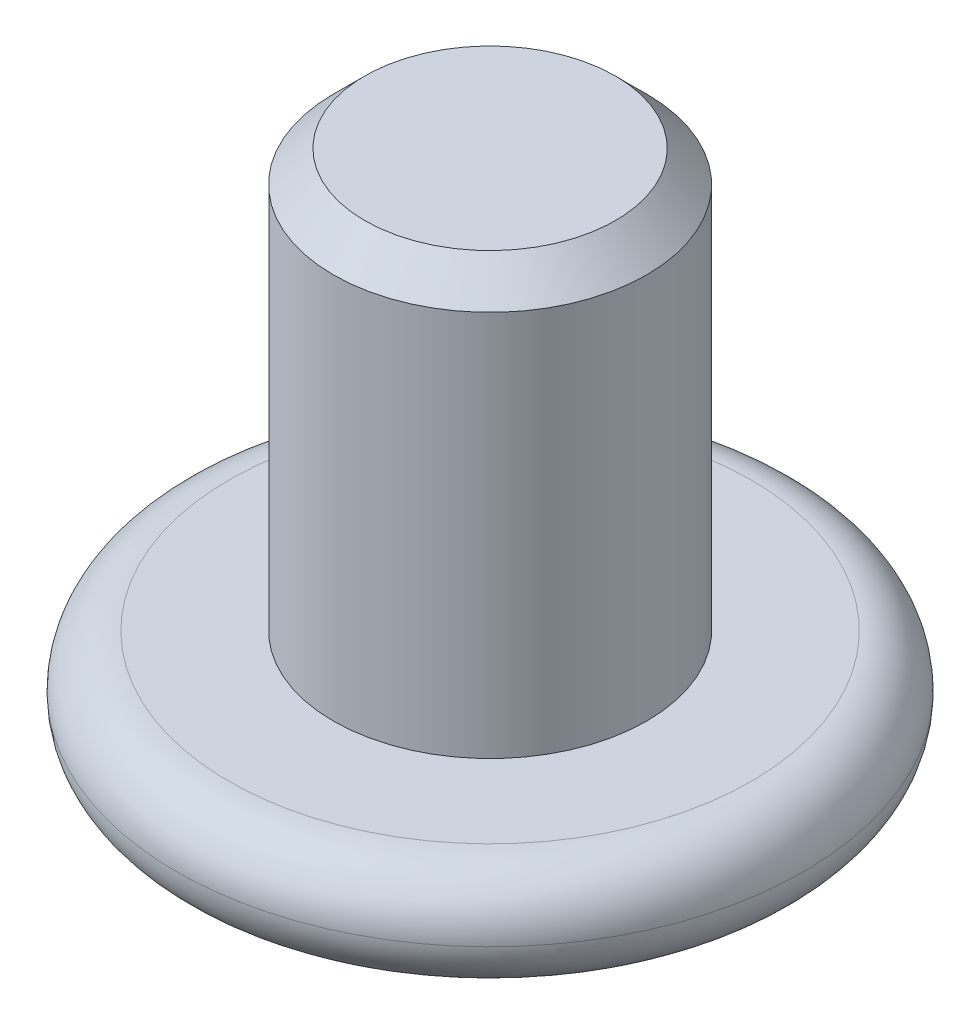
ISO-10303-21;
HEADER;
FILE_DESCRIPTION(('STEP AP214'),'2;1');
FILE_NAME('part.step','',(''),(''),'','','');
FILE_SCHEMA(('AUTOMOTIVE_DESIGN { 1 0 10303 214 1 1 1 1 }'));
ENDSEC;
DATA;
#1=APPLICATION_CONTEXT('core data for automotive mechanical design processes');
#2=APPLICATION_PROTOCOL_DEFINITION('international standard','automotive_design',2000,#1);
#3=PRODUCT_CONTEXT('',#1,'mechanical');
#4=PRODUCT('Part','Part','',(#3));
#5=PRODUCT_RELATED_PRODUCT_CATEGORY('part','',(#4));
#6=PRODUCT_DEFINITION_FORMATION('','',#4);
#7=PRODUCT_DEFINITION_CONTEXT('part definition',#1,'design');
#8=PRODUCT_DEFINITION('design','',#6,#7);
#9=PRODUCT_DEFINITION_SHAPE('','',#8);
#10=(LENGTH_UNIT() NAMED_UNIT(*) SI_UNIT(.MILLI.,.METRE.));
#11=(NAMED_UNIT(*) PLANE_ANGLE_UNIT() SI_UNIT($,.RADIAN.));
#12=(NAMED_UNIT(*) SI_UNIT($,.STERADIAN.) SOLID_ANGLE_UNIT());
#13=UNCERTAINTY_MEASURE_WITH_UNIT(LENGTH_MEASURE(1.E-05),#10,'distance_accuracy_value','');
#14=(GEOMETRIC_REPRESENTATION_CONTEXT(3) GLOBAL_UNCERTAINTY_ASSIGNED_CONTEXT((#13)) GLOBAL_UNIT_ASSIGNED_CONTEXT((#10,
#11,#12)) REPRESENTATION_CONTEXT('',''));
#15=CARTESIAN_POINT('',(0.,0.,0.));
#16=DIRECTION('',(0.,0.,1.));
#17=DIRECTION('',(1.,0.,0.));
#18=AXIS2_PLACEMENT_3D('',#15,#16,#17);
#19=CARTESIAN_POINT('',(0.,4.,0.));
#20=DIRECTION('',(0.,-1.,0.));
#21=DIRECTION('',(0.,0.,-1.));
#22=AXIS2_PLACEMENT_3D('',#19,#20,#21);
#23=CYLINDRICAL_SURFACE('',#22,1.5);
#24=CARTESIAN_POINT('',(0.,3.7,0.));
#25=DIRECTION('',(0.,1.,0.));
#26=DIRECTION('',(0.,0.,1.));
#27=AXIS2_PLACEMENT_3D('',#24,#25,#26);
#28=CIRCLE('',#27,1.5);
#29=CARTESIAN_POINT('',(0.,3.7,1.5));
#30=VERTEX_POINT('',#29);
#31=EDGE_CURVE('E11',#30,#30,#28,.F.);
#32=ORIENTED_EDGE('',*,*,#31,.T.);
#33=EDGE_LOOP('',(#32));
#34=FACE_BOUND('',#33,.T.);
#35=CARTESIAN_POINT('',(0.,0.,0.));
#36=DIRECTION('',(0.,1.,0.));
#37=DIRECTION('',(0.,0.,1.));
#38=AXIS2_PLACEMENT_3D('',#35,#36,#37);
#39=CIRCLE('',#38,1.5);
#40=CARTESIAN_POINT('',(0.,0.,1.5));
#41=VERTEX_POINT('',#40);
#42=EDGE_CURVE('E250',#41,#41,#39,.T.);
#43=ORIENTED_EDGE('',*,*,#42,.T.);
#44=EDGE_LOOP('',(#43));
#45=FACE_BOUND('',#44,.T.);
#46=ADVANCED_FACE('F46',(#34,#45),#23,.T.);
#47=CARTESIAN_POINT('',(0.,4.,0.));
#48=DIRECTION('',(0.,1.,0.));
#49=DIRECTION('',(0.,0.,1.));
#50=AXIS2_PLACEMENT_3D('',#47,#48,#49);
#51=PLANE('',#50);
#52=CARTESIAN_POINT('',(0.,4.,0.));
#53=DIRECTION('',(0.,1.,0.));
#54=DIRECTION('',(0.,0.,1.));
#55=AXIS2_PLACEMENT_3D('',#52,#53,#54);
#56=CIRCLE('',#55,1.2);
#57=CARTESIAN_POINT('',(0.,4.,1.2));
#58=VERTEX_POINT('',#57);
#59=EDGE_CURVE('E56',#58,#58,#56,.T.);
#60=ORIENTED_EDGE('',*,*,#59,.T.);
#61=EDGE_LOOP('',(#60));
#62=FACE_BOUND('',#61,.T.);
#63=ADVANCED_FACE('F268',(#62),#51,.T.);
#64=CARTESIAN_POINT('',(0.,-1.,0.));
#65=DIRECTION('',(0.,-1.,0.));
#66=DIRECTION('',(0.,0.,-1.));
#67=AXIS2_PLACEMENT_3D('',#64,#65,#66);
#68=PLANE('',#67);
#69=DIRECTION('',(0.,0.,-1.));
#70=VECTOR('',#69,1.);
#71=CARTESIAN_POINT('',(-1.5,-1.,-0.2));
#72=LINE('',#71,#70);
#73=CARTESIAN_POINT('',(-1.5,-1.,0.2));
#74=VERTEX_POINT('',#73);
#75=CARTESIAN_POINT('',(-1.5,-1.,-0.2));
#76=VERTEX_POINT('',#75);
#77=EDGE_CURVE('E63',#74,#76,#72,.T.);
#78=ORIENTED_EDGE('',*,*,#77,.F.);
#79=DIRECTION('',(-1.,0.,0.));
#80=VECTOR('',#79,1.);
#81=CARTESIAN_POINT('',(-1.5,-1.,0.2));
#82=LINE('',#81,#80);
#83=CARTESIAN_POINT('',(-0.2,-1.,0.2));
#84=VERTEX_POINT('',#83);
#85=EDGE_CURVE('E216',#84,#74,#82,.T.);
#86=ORIENTED_EDGE('',*,*,#85,.F.);
#87=DIRECTION('',(0.,0.,-1.));
#88=VECTOR('',#87,1.);
#89=CARTESIAN_POINT('',(-0.2,-1.,1.5));
#90=LINE('',#89,#88);
#91=CARTESIAN_POINT('',(-0.2,-1.,1.5));
#92=VERTEX_POINT('',#91);
#93=EDGE_CURVE('E213',#92,#84,#90,.T.);
#94=ORIENTED_EDGE('',*,*,#93,.F.);
#95=DIRECTION('',(-1.,0.,0.));
#96=VECTOR('',#95,1.);
#97=CARTESIAN_POINT('',(-0.2,-1.,1.5));
#98=LINE('',#97,#96);
#99=CARTESIAN_POINT('',(0.2,-1.,1.5));
#100=VERTEX_POINT('',#99);
#101=EDGE_CURVE('E147',#100,#92,#98,.T.);
#102=ORIENTED_EDGE('',*,*,#101,.F.);
#103=DIRECTION('',(0.,0.,1.));
#104=VECTOR('',#103,1.);
#105=CARTESIAN_POINT('',(0.2,-1.,1.5));
#106=LINE('',#105,#104);
#107=CARTESIAN_POINT('',(0.2,-1.,0.2));
#108=VERTEX_POINT('',#107);
#109=EDGE_CURVE('E207',#108,#100,#106,.T.);
#110=ORIENTED_EDGE('',*,*,#109,.F.);
#111=DIRECTION('',(-1.,0.,0.));
#112=VECTOR('',#111,1.);
#113=CARTESIAN_POINT('',(0.2,-1.,0.2));
#114=LINE('',#113,#112);
#115=CARTESIAN_POINT('',(1.5,-1.,0.2));
#116=VERTEX_POINT('',#115);
#117=EDGE_CURVE('E203',#116,#108,#114,.T.);
#118=ORIENTED_EDGE('',*,*,#117,.F.);
#119=DIRECTION('',(0.,0.,1.));
#120=VECTOR('',#119,1.);
#121=CARTESIAN_POINT('',(1.5,-1.,-0.2));
#122=LINE('',#121,#120);
#123=CARTESIAN_POINT('',(1.5,-1.,-0.2));
#124=VERTEX_POINT('',#123);
#125=EDGE_CURVE('E199',#124,#116,#122,.T.);
#126=ORIENTED_EDGE('',*,*,#125,.F.);
#127=DIRECTION('',(1.,0.,0.));
#128=VECTOR('',#127,1.);
#129=CARTESIAN_POINT('',(0.2,-1.,-0.2));
#130=LINE('',#129,#128);
#131=CARTESIAN_POINT('',(0.2,-1.,-0.2));
#132=VERTEX_POINT('',#131);
#133=EDGE_CURVE('E195',#132,#124,#130,.T.);
#134=ORIENTED_EDGE('',*,*,#133,.F.);
#135=DIRECTION('',(0.,0.,1.));
#136=VECTOR('',#135,1.);
#137=CARTESIAN_POINT('',(0.2,-1.,-0.2));
#138=LINE('',#137,#136);
#139=CARTESIAN_POINT('',(0.2,-1.,-1.5));
#140=VERTEX_POINT('',#139);
#141=EDGE_CURVE('E191',#140,#132,#138,.T.);
#142=ORIENTED_EDGE('',*,*,#141,.F.);
#143=DIRECTION('',(1.,0.,0.));
#144=VECTOR('',#143,1.);
#145=CARTESIAN_POINT('',(-0.2,-1.,-1.5));
#146=LINE('',#145,#144);
#147=CARTESIAN_POINT('',(-0.2,-1.,-1.5));
#148=VERTEX_POINT('',#147);
#149=EDGE_CURVE('E187',#148,#140,#146,.T.);
#150=ORIENTED_EDGE('',*,*,#149,.F.);
#151=DIRECTION('',(0.,0.,-1.));
#152=VECTOR('',#151,1.);
#153=CARTESIAN_POINT('',(-0.2,-1.,-0.2));
#154=LINE('',#153,#152);
#155=CARTESIAN_POINT('',(-0.2,-1.,-0.2));
#156=VERTEX_POINT('',#155);
#157=EDGE_CURVE('E183',#156,#148,#154,.T.);
#158=ORIENTED_EDGE('',*,*,#157,.F.);
#159=DIRECTION('',(1.,0.,0.));
#160=VECTOR('',#159,1.);
#161=CARTESIAN_POINT('',(-1.5,-1.,-0.2));
#162=LINE('',#161,#160);
#163=EDGE_CURVE('E179',#76,#156,#162,.T.);
#164=ORIENTED_EDGE('',*,*,#163,.F.);
#165=EDGE_LOOP('',(#78,#86,#94,#102,#110,#118,#126,#134,#142,#150,#158,#164));
#166=FACE_BOUND('',#165,.T.);
#167=CARTESIAN_POINT('',(0.,-1.,0.));
#168=DIRECTION('',(0.,-1.,0.));
#169=DIRECTION('',(0.,0.,-1.));
#170=AXIS2_PLACEMENT_3D('',#167,#168,#169);
#171=CIRCLE('',#170,2.5);
#172=CARTESIAN_POINT('',(0.,-1.,-2.5));
#173=VERTEX_POINT('',#172);
#174=EDGE_CURVE('E258',#173,#173,#171,.T.);
#175=ORIENTED_EDGE('',*,*,#174,.T.);
#176=EDGE_LOOP('',(#175));
#177=FACE_BOUND('',#176,.T.);
#178=ADVANCED_FACE('F284',(#166,#177),#68,.T.);
#179=CARTESIAN_POINT('',(0.,0.,0.));
#180=DIRECTION('',(0.,-1.,0.));
#181=DIRECTION('',(0.,0.,-1.));
#182=AXIS2_PLACEMENT_3D('',#179,#180,#181);
#183=PLANE('',#182);
#184=CARTESIAN_POINT('',(0.,0.,0.));
#185=DIRECTION('',(0.,-1.,0.));
#186=DIRECTION('',(0.,0.,-1.));
#187=AXIS2_PLACEMENT_3D('',#184,#185,#186);
#188=CIRCLE('',#187,2.5);
#189=CARTESIAN_POINT('',(0.,0.,-2.5));
#190=VERTEX_POINT('',#189);
#191=EDGE_CURVE('E254',#190,#190,#188,.F.);
#192=ORIENTED_EDGE('',*,*,#191,.T.);
#193=EDGE_LOOP('',(#192));
#194=FACE_BOUND('',#193,.T.);
#195=ORIENTED_EDGE('',*,*,#42,.F.);
#196=EDGE_LOOP('',(#195));
#197=FACE_BOUND('',#196,.T.);
#198=ADVANCED_FACE('F295',(#194,#197),#183,.F.);
#199=CARTESIAN_POINT('',(0.,-0.5,0.));
#200=DIRECTION('',(0.,-1.,0.));
#201=DIRECTION('',(0.,0.,-1.));
#202=AXIS2_PLACEMENT_3D('',#199,#200,#201);
#203=TOROIDAL_SURFACE('',#202,2.5,0.5);
#204=ORIENTED_EDGE('',*,*,#174,.F.);
#205=EDGE_LOOP('',(#204));
#206=FACE_BOUND('',#205,.T.);
#207=CARTESIAN_POINT('',(0.,-0.5,0.));
#208=DIRECTION('',(0.,-1.,0.));
#209=DIRECTION('',(0.,0.,-1.));
#210=AXIS2_PLACEMENT_3D('',#207,#208,#209);
#211=CIRCLE('',#210,3.);
#212=CARTESIAN_POINT('',(0.,-0.5,-3.));
#213=VERTEX_POINT('',#212);
#214=EDGE_CURVE('E222',#213,#213,#211,.F.);
#215=ORIENTED_EDGE('',*,*,#214,.F.);
#216=EDGE_LOOP('',(#215));
#217=FACE_BOUND('',#216,.T.);
#218=ADVANCED_FACE('F292',(#206,#217),#203,.T.);
#219=CARTESIAN_POINT('',(0.,-0.5,0.));
#220=DIRECTION('',(0.,-1.,0.));
#221=DIRECTION('',(0.,0.,-1.));
#222=AXIS2_PLACEMENT_3D('',#219,#220,#221);
#223=TOROIDAL_SURFACE('',#222,2.5,0.5);
#224=ORIENTED_EDGE('',*,*,#191,.F.);
#225=EDGE_LOOP('',(#224));
#226=FACE_BOUND('',#225,.T.);
#227=ORIENTED_EDGE('',*,*,#214,.T.);
#228=EDGE_LOOP('',(#227));
#229=FACE_BOUND('',#228,.T.);
#230=ADVANCED_FACE('F289',(#226,#229),#223,.T.);
#231=CARTESIAN_POINT('',(-1.5,-0.5,-0.2));
#232=DIRECTION('',(-1.,0.,0.));
#233=DIRECTION('',(0.,0.,1.));
#234=AXIS2_PLACEMENT_3D('',#231,#232,#233);
#235=PLANE('',#234);
#236=ORIENTED_EDGE('',*,*,#77,.T.);
#237=DIRECTION('',(0.,-1.,0.));
#238=VECTOR('',#237,1.);
#239=CARTESIAN_POINT('',(-1.5,-0.5,-0.2));
#240=LINE('',#239,#238);
#241=CARTESIAN_POINT('',(-1.5,-0.5,-0.2));
#242=VERTEX_POINT('',#241);
#243=EDGE_CURVE('E111',#242,#76,#240,.T.);
#244=ORIENTED_EDGE('',*,*,#243,.F.);
#245=DIRECTION('',(0.,0.,-1.));
#246=VECTOR('',#245,1.);
#247=CARTESIAN_POINT('',(-1.5,-0.5,-0.2));
#248=LINE('',#247,#246);
#249=CARTESIAN_POINT('',(-1.5,-0.5,0.2));
#250=VERTEX_POINT('',#249);
#251=EDGE_CURVE('E219',#250,#242,#248,.T.);
#252=ORIENTED_EDGE('',*,*,#251,.F.);
#253=DIRECTION('',(0.,-1.,0.));
#254=VECTOR('',#253,1.);
#255=CARTESIAN_POINT('',(-1.5,-0.5,0.2));
#256=LINE('',#255,#254);
#257=EDGE_CURVE('E71',#250,#74,#256,.T.);
#258=ORIENTED_EDGE('',*,*,#257,.T.);
#259=EDGE_LOOP('',(#236,#244,#252,#258));
#260=FACE_BOUND('',#259,.T.);
#261=ADVANCED_FACE('F291',(#260),#235,.F.);
#262=CARTESIAN_POINT('',(-1.5,-0.5,0.2));
#263=DIRECTION('',(0.,0.,1.));
#264=DIRECTION('',(1.,0.,0.));
#265=AXIS2_PLACEMENT_3D('',#262,#263,#264);
#266=PLANE('',#265);
#267=ORIENTED_EDGE('',*,*,#85,.T.);
#268=ORIENTED_EDGE('',*,*,#257,.F.);
#269=DIRECTION('',(-1.,0.,0.));
#270=VECTOR('',#269,1.);
#271=CARTESIAN_POINT('',(-1.5,-0.5,0.2));
#272=LINE('',#271,#270);
#273=CARTESIAN_POINT('',(-0.2,-0.5,0.2));
#274=VERTEX_POINT('',#273);
#275=EDGE_CURVE('E161',#274,#250,#272,.T.);
#276=ORIENTED_EDGE('',*,*,#275,.F.);
#277=DIRECTION('',(0.,-1.,0.));
#278=VECTOR('',#277,1.);
#279=CARTESIAN_POINT('',(-0.2,-0.5,0.2));
#280=LINE('',#279,#278);
#281=EDGE_CURVE('E152',#274,#84,#280,.T.);
#282=ORIENTED_EDGE('',*,*,#281,.T.);
#283=EDGE_LOOP('',(#267,#268,#276,#282));
#284=FACE_BOUND('',#283,.T.);
#285=ADVANCED_FACE('F314',(#284),#266,.F.);
#286=CARTESIAN_POINT('',(-0.2,-0.5,1.5));
#287=DIRECTION('',(-1.,0.,0.));
#288=DIRECTION('',(0.,0.,1.));
#289=AXIS2_PLACEMENT_3D('',#286,#287,#288);
#290=PLANE('',#289);
#291=ORIENTED_EDGE('',*,*,#93,.T.);
#292=ORIENTED_EDGE('',*,*,#281,.F.);
#293=DIRECTION('',(0.,0.,-1.));
#294=VECTOR('',#293,1.);
#295=CARTESIAN_POINT('',(-0.2,-0.5,1.5));
#296=LINE('',#295,#294);
#297=CARTESIAN_POINT('',(-0.2,-0.5,1.5));
#298=VERTEX_POINT('',#297);
#299=EDGE_CURVE('E156',#298,#274,#296,.T.);
#300=ORIENTED_EDGE('',*,*,#299,.F.);
#301=DIRECTION('',(0.,-1.,0.));
#302=VECTOR('',#301,1.);
#303=CARTESIAN_POINT('',(-0.2,-0.5,1.5));
#304=LINE('',#303,#302);
#305=EDGE_CURVE('E140',#298,#92,#304,.T.);
#306=ORIENTED_EDGE('',*,*,#305,.T.);
#307=EDGE_LOOP('',(#291,#292,#300,#306));
#308=FACE_BOUND('',#307,.T.);
#309=ADVANCED_FACE('F157',(#308),#290,.F.);
#310=CARTESIAN_POINT('',(-0.2,-0.5,1.5));
#311=DIRECTION('',(0.,0.,1.));
#312=DIRECTION('',(1.,0.,0.));
#313=AXIS2_PLACEMENT_3D('',#310,#311,#312);
#314=PLANE('',#313);
#315=ORIENTED_EDGE('',*,*,#101,.T.);
#316=ORIENTED_EDGE('',*,*,#305,.F.);
#317=DIRECTION('',(-1.,0.,0.));
#318=VECTOR('',#317,1.);
#319=CARTESIAN_POINT('',(-0.2,-0.5,1.5));
#320=LINE('',#319,#318);
#321=CARTESIAN_POINT('',(0.2,-0.5,1.5));
#322=VERTEX_POINT('',#321);
#323=EDGE_CURVE('E144',#322,#298,#320,.T.);
#324=ORIENTED_EDGE('',*,*,#323,.F.);
#325=DIRECTION('',(0.,-1.,0.));
#326=VECTOR('',#325,1.);
#327=CARTESIAN_POINT('',(0.2,-0.5,1.5));
#328=LINE('',#327,#326);
#329=EDGE_CURVE('E153',#322,#100,#328,.T.);
#330=ORIENTED_EDGE('',*,*,#329,.T.);
#331=EDGE_LOOP('',(#315,#316,#324,#330));
#332=FACE_BOUND('',#331,.T.);
#333=ADVANCED_FACE('F142',(#332),#314,.F.);
#334=CARTESIAN_POINT('',(0.2,-0.5,1.5));
#335=DIRECTION('',(1.,0.,0.));
#336=DIRECTION('',(0.,0.,-1.));
#337=AXIS2_PLACEMENT_3D('',#334,#335,#336);
#338=PLANE('',#337);
#339=ORIENTED_EDGE('',*,*,#109,.T.);
#340=ORIENTED_EDGE('',*,*,#329,.F.);
#341=DIRECTION('',(0.,0.,1.));
#342=VECTOR('',#341,1.);
#343=CARTESIAN_POINT('',(0.2,-0.5,1.5));
#344=LINE('',#343,#342);
#345=CARTESIAN_POINT('',(0.2,-0.5,0.2));
#346=VERTEX_POINT('',#345);
#347=EDGE_CURVE('E167',#346,#322,#344,.T.);
#348=ORIENTED_EDGE('',*,*,#347,.F.);
#349=DIRECTION('',(0.,-1.,0.));
#350=VECTOR('',#349,1.);
#351=CARTESIAN_POINT('',(0.2,-0.5,0.2));
#352=LINE('',#351,#350);
#353=EDGE_CURVE('E227',#346,#108,#352,.T.);
#354=ORIENTED_EDGE('',*,*,#353,.T.);
#355=EDGE_LOOP('',(#339,#340,#348,#354));
#356=FACE_BOUND('',#355,.T.);
#357=ADVANCED_FACE('F341',(#356),#338,.F.);
#358=CARTESIAN_POINT('',(0.2,-0.5,0.2));
#359=DIRECTION('',(0.,0.,1.));
#360=DIRECTION('',(1.,0.,0.));
#361=AXIS2_PLACEMENT_3D('',#358,#359,#360);
#362=PLANE('',#361);
#363=ORIENTED_EDGE('',*,*,#117,.T.);
#364=ORIENTED_EDGE('',*,*,#353,.F.);
#365=DIRECTION('',(-1.,0.,0.));
#366=VECTOR('',#365,1.);
#367=CARTESIAN_POINT('',(0.2,-0.5,0.2));
#368=LINE('',#367,#366);
#369=CARTESIAN_POINT('',(1.5,-0.5,0.2));
#370=VERTEX_POINT('',#369);
#371=EDGE_CURVE('E171',#370,#346,#368,.T.);
#372=ORIENTED_EDGE('',*,*,#371,.F.);
#373=DIRECTION('',(0.,-1.,0.));
#374=VECTOR('',#373,1.);
#375=CARTESIAN_POINT('',(1.5,-0.5,0.2));
#376=LINE('',#375,#374);
#377=EDGE_CURVE('E230',#370,#116,#376,.T.);
#378=ORIENTED_EDGE('',*,*,#377,.T.);
#379=EDGE_LOOP('',(#363,#364,#372,#378));
#380=FACE_BOUND('',#379,.T.);
#381=ADVANCED_FACE('F337',(#380),#362,.F.);
#382=CARTESIAN_POINT('',(1.5,-0.5,-0.2));
#383=DIRECTION('',(1.,0.,0.));
#384=DIRECTION('',(0.,0.,-1.));
#385=AXIS2_PLACEMENT_3D('',#382,#383,#384);
#386=PLANE('',#385);
#387=ORIENTED_EDGE('',*,*,#125,.T.);
#388=ORIENTED_EDGE('',*,*,#377,.F.);
#389=DIRECTION('',(0.,0.,1.));
#390=VECTOR('',#389,1.);
#391=CARTESIAN_POINT('',(1.5,-0.5,-0.2));
#392=LINE('',#391,#390);
#393=CARTESIAN_POINT('',(1.5,-0.5,-0.2));
#394=VERTEX_POINT('',#393);
#395=EDGE_CURVE('E381',#394,#370,#392,.T.);
#396=ORIENTED_EDGE('',*,*,#395,.F.);
#397=DIRECTION('',(0.,-1.,0.));
#398=VECTOR('',#397,1.);
#399=CARTESIAN_POINT('',(1.5,-0.5,-0.2));
#400=LINE('',#399,#398);
#401=EDGE_CURVE('E233',#394,#124,#400,.T.);
#402=ORIENTED_EDGE('',*,*,#401,.T.);
#403=EDGE_LOOP('',(#387,#388,#396,#402));
#404=FACE_BOUND('',#403,.T.);
#405=ADVANCED_FACE('F333',(#404),#386,.F.);
#406=CARTESIAN_POINT('',(0.2,-0.5,-0.2));
#407=DIRECTION('',(0.,0.,-1.));
#408=DIRECTION('',(-1.,0.,0.));
#409=AXIS2_PLACEMENT_3D('',#406,#407,#408);
#410=PLANE('',#409);
#411=ORIENTED_EDGE('',*,*,#133,.T.);
#412=ORIENTED_EDGE('',*,*,#401,.F.);
#413=DIRECTION('',(1.,0.,0.));
#414=VECTOR('',#413,1.);
#415=CARTESIAN_POINT('',(0.2,-0.5,-0.2));
#416=LINE('',#415,#414);
#417=CARTESIAN_POINT('',(0.2,-0.5,-0.2));
#418=VERTEX_POINT('',#417);
#419=EDGE_CURVE('E377',#418,#394,#416,.T.);
#420=ORIENTED_EDGE('',*,*,#419,.F.);
#421=DIRECTION('',(0.,-1.,0.));
#422=VECTOR('',#421,1.);
#423=CARTESIAN_POINT('',(0.2,-0.5,-0.2));
#424=LINE('',#423,#422);
#425=EDGE_CURVE('E236',#418,#132,#424,.T.);
#426=ORIENTED_EDGE('',*,*,#425,.T.);
#427=EDGE_LOOP('',(#411,#412,#420,#426));
#428=FACE_BOUND('',#427,.T.);
#429=ADVANCED_FACE('F329',(#428),#410,.F.);
#430=CARTESIAN_POINT('',(0.2,-0.5,-0.2));
#431=DIRECTION('',(1.,0.,0.));
#432=DIRECTION('',(0.,0.,-1.));
#433=AXIS2_PLACEMENT_3D('',#430,#431,#432);
#434=PLANE('',#433);
#435=ORIENTED_EDGE('',*,*,#141,.T.);
#436=ORIENTED_EDGE('',*,*,#425,.F.);
#437=DIRECTION('',(0.,0.,1.));
#438=VECTOR('',#437,1.);
#439=CARTESIAN_POINT('',(0.2,-0.5,-0.2));
#440=LINE('',#439,#438);
#441=CARTESIAN_POINT('',(0.2,-0.5,-1.5));
#442=VERTEX_POINT('',#441);
#443=EDGE_CURVE('E373',#442,#418,#440,.T.);
#444=ORIENTED_EDGE('',*,*,#443,.F.);
#445=DIRECTION('',(0.,-1.,0.));
#446=VECTOR('',#445,1.);
#447=CARTESIAN_POINT('',(0.2,-0.5,-1.5));
#448=LINE('',#447,#446);
#449=EDGE_CURVE('E239',#442,#140,#448,.T.);
#450=ORIENTED_EDGE('',*,*,#449,.T.);
#451=EDGE_LOOP('',(#435,#436,#444,#450));
#452=FACE_BOUND('',#451,.T.);
#453=ADVANCED_FACE('F325',(#452),#434,.F.);
#454=CARTESIAN_POINT('',(-0.2,-0.5,-1.5));
#455=DIRECTION('',(0.,0.,-1.));
#456=DIRECTION('',(-1.,0.,0.));
#457=AXIS2_PLACEMENT_3D('',#454,#455,#456);
#458=PLANE('',#457);
#459=ORIENTED_EDGE('',*,*,#149,.T.);
#460=ORIENTED_EDGE('',*,*,#449,.F.);
#461=DIRECTION('',(1.,0.,0.));
#462=VECTOR('',#461,1.);
#463=CARTESIAN_POINT('',(-0.2,-0.5,-1.5));
#464=LINE('',#463,#462);
#465=CARTESIAN_POINT('',(-0.2,-0.5,-1.5));
#466=VERTEX_POINT('',#465);
#467=EDGE_CURVE('E369',#466,#442,#464,.T.);
#468=ORIENTED_EDGE('',*,*,#467,.F.);
#469=DIRECTION('',(0.,-1.,0.));
#470=VECTOR('',#469,1.);
#471=CARTESIAN_POINT('',(-0.2,-0.5,-1.5));
#472=LINE('',#471,#470);
#473=EDGE_CURVE('E242',#466,#148,#472,.T.);
#474=ORIENTED_EDGE('',*,*,#473,.T.);
#475=EDGE_LOOP('',(#459,#460,#468,#474));
#476=FACE_BOUND('',#475,.T.);
#477=ADVANCED_FACE('F321',(#476),#458,.F.);
#478=CARTESIAN_POINT('',(-0.2,-0.5,-0.2));
#479=DIRECTION('',(-1.,0.,0.));
#480=DIRECTION('',(0.,0.,1.));
#481=AXIS2_PLACEMENT_3D('',#478,#479,#480);
#482=PLANE('',#481);
#483=ORIENTED_EDGE('',*,*,#157,.T.);
#484=ORIENTED_EDGE('',*,*,#473,.F.);
#485=DIRECTION('',(0.,0.,-1.));
#486=VECTOR('',#485,1.);
#487=CARTESIAN_POINT('',(-0.2,-0.5,-0.2));
#488=LINE('',#487,#486);
#489=CARTESIAN_POINT('',(-0.2,-0.5,-0.2));
#490=VERTEX_POINT('',#489);
#491=EDGE_CURVE('E362',#490,#466,#488,.T.);
#492=ORIENTED_EDGE('',*,*,#491,.F.);
#493=DIRECTION('',(0.,-1.,0.));
#494=VECTOR('',#493,1.);
#495=CARTESIAN_POINT('',(-0.2,-0.5,-0.2));
#496=LINE('',#495,#494);
#497=EDGE_CURVE('E245',#490,#156,#496,.T.);
#498=ORIENTED_EDGE('',*,*,#497,.T.);
#499=EDGE_LOOP('',(#483,#484,#492,#498));
#500=FACE_BOUND('',#499,.T.);
#501=ADVANCED_FACE('F317',(#500),#482,.F.);
#502=CARTESIAN_POINT('',(-1.5,-0.5,-0.2));
#503=DIRECTION('',(0.,0.,-1.));
#504=DIRECTION('',(-1.,0.,0.));
#505=AXIS2_PLACEMENT_3D('',#502,#503,#504);
#506=PLANE('',#505);
#507=ORIENTED_EDGE('',*,*,#163,.T.);
#508=ORIENTED_EDGE('',*,*,#497,.F.);
#509=DIRECTION('',(1.,0.,0.));
#510=VECTOR('',#509,1.);
#511=CARTESIAN_POINT('',(-1.5,-0.5,-0.2));
#512=LINE('',#511,#510);
#513=EDGE_CURVE('E359',#242,#490,#512,.T.);
#514=ORIENTED_EDGE('',*,*,#513,.F.);
#515=ORIENTED_EDGE('',*,*,#243,.T.);
#516=EDGE_LOOP('',(#507,#508,#514,#515));
#517=FACE_BOUND('',#516,.T.);
#518=ADVANCED_FACE('F276',(#517),#506,.F.);
#519=CARTESIAN_POINT('',(0.,-0.5,0.));
#520=DIRECTION('',(0.,1.,0.));
#521=DIRECTION('',(0.,0.,1.));
#522=AXIS2_PLACEMENT_3D('',#519,#520,#521);
#523=PLANE('',#522);
#524=ORIENTED_EDGE('',*,*,#251,.T.);
#525=ORIENTED_EDGE('',*,*,#513,.T.);
#526=ORIENTED_EDGE('',*,*,#491,.T.);
#527=ORIENTED_EDGE('',*,*,#467,.T.);
#528=ORIENTED_EDGE('',*,*,#443,.T.);
#529=ORIENTED_EDGE('',*,*,#419,.T.);
#530=ORIENTED_EDGE('',*,*,#395,.T.);
#531=ORIENTED_EDGE('',*,*,#371,.T.);
#532=ORIENTED_EDGE('',*,*,#347,.T.);
#533=ORIENTED_EDGE('',*,*,#323,.T.);
#534=ORIENTED_EDGE('',*,*,#299,.T.);
#535=ORIENTED_EDGE('',*,*,#275,.T.);
#536=EDGE_LOOP('',(#524,#525,#526,#527,#528,#529,#530,#531,#532,#533,#534,#535));
#537=FACE_BOUND('',#536,.T.);
#538=ADVANCED_FACE('F164',(#537),#523,.F.);
#539=CARTESIAN_POINT('',(0.,4.,0.));
#540=DIRECTION('',(0.,-1.,0.));
#541=DIRECTION('',(0.,0.,-1.));
#542=AXIS2_PLACEMENT_3D('',#539,#540,#541);
#543=CONICAL_SURFACE('',#542,1.2,0.785398163397446);
#544=ORIENTED_EDGE('',*,*,#31,.F.);
#545=EDGE_LOOP('',(#544));
#546=FACE_BOUND('',#545,.T.);
#547=ORIENTED_EDGE('',*,*,#59,.F.);
#548=EDGE_LOOP('',(#547));
#549=FACE_BOUND('',#548,.T.);
#550=ADVANCED_FACE('F49',(#546,#549),#543,.T.);
#551=CLOSED_SHELL('',(#46,#63,#178,#198,#218,#230,#261,#285,#309,#333,#357,#381,#405,#429,#453,
#477,#501,#518,#538,#550));
#552=MANIFOLD_SOLID_BREP('B2',#551);
#553=ADVANCED_BREP_SHAPE_REPRESENTATION('',(#18,#552),#14);
#554=SHAPE_DEFINITION_REPRESENTATION(#9,#553);
ENDSEC;
END-ISO-10303-21;
